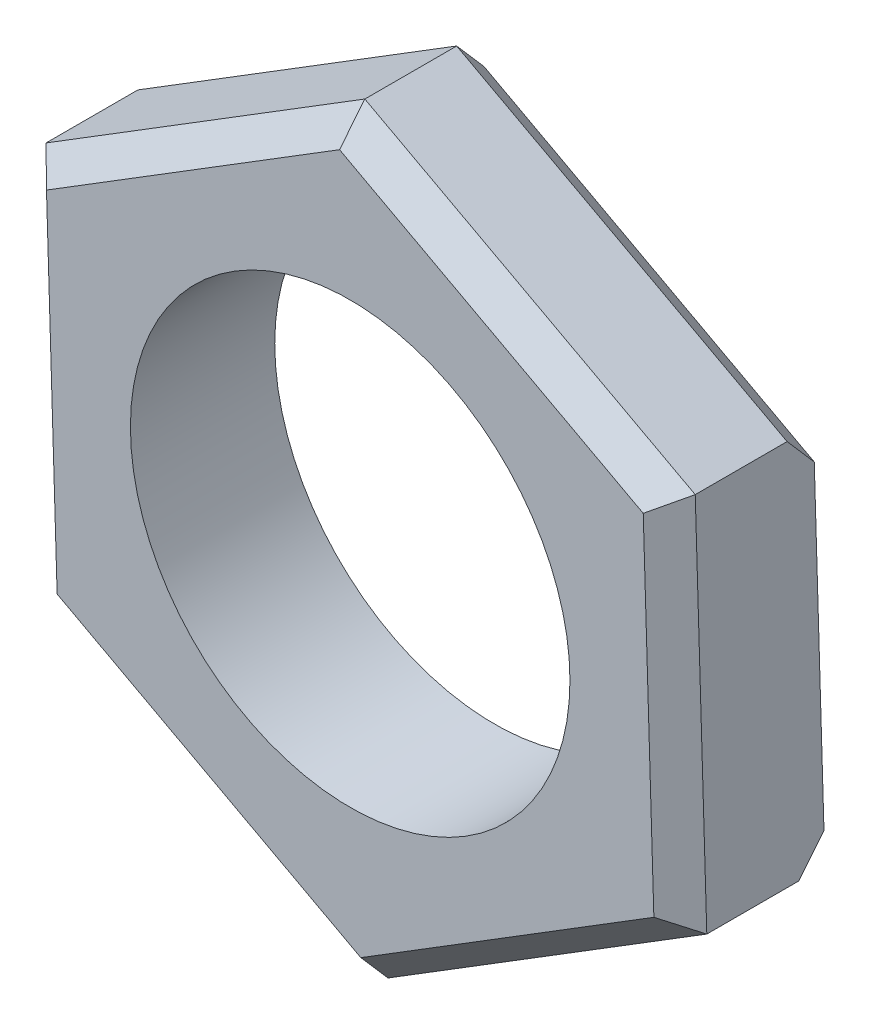
ISO-10303-21;
HEADER;
FILE_DESCRIPTION(('STEP AP214'),'2;1');
FILE_NAME('part.step','',(''),(''),'','','');
FILE_SCHEMA(('AUTOMOTIVE_DESIGN { 1 0 10303 214 1 1 1 1 }'));
ENDSEC;
DATA;
#1=APPLICATION_CONTEXT('core data for automotive mechanical design processes');
#2=APPLICATION_PROTOCOL_DEFINITION('international standard','automotive_design',2000,#1);
#3=PRODUCT_CONTEXT('',#1,'mechanical');
#4=PRODUCT('Part','Part','',(#3));
#5=PRODUCT_RELATED_PRODUCT_CATEGORY('part','',(#4));
#6=PRODUCT_DEFINITION_FORMATION('','',#4);
#7=PRODUCT_DEFINITION_CONTEXT('part definition',#1,'design');
#8=PRODUCT_DEFINITION('design','',#6,#7);
#9=PRODUCT_DEFINITION_SHAPE('','',#8);
#10=(LENGTH_UNIT() NAMED_UNIT(*) SI_UNIT(.MILLI.,.METRE.));
#11=(NAMED_UNIT(*) PLANE_ANGLE_UNIT() SI_UNIT($,.RADIAN.));
#12=(NAMED_UNIT(*) SI_UNIT($,.STERADIAN.) SOLID_ANGLE_UNIT());
#13=UNCERTAINTY_MEASURE_WITH_UNIT(LENGTH_MEASURE(1.E-05),#10,'distance_accuracy_value','');
#14=(GEOMETRIC_REPRESENTATION_CONTEXT(3) GLOBAL_UNCERTAINTY_ASSIGNED_CONTEXT((#13)) GLOBAL_UNIT_ASSIGNED_CONTEXT((#10,
#11,#12)) REPRESENTATION_CONTEXT('',''));
#15=CARTESIAN_POINT('',(0.,0.,0.));
#16=DIRECTION('',(0.,0.,1.));
#17=DIRECTION('',(1.,0.,0.));
#18=AXIS2_PLACEMENT_3D('',#15,#16,#17);
#19=CARTESIAN_POINT('',(0.,0.,2.2));
#20=DIRECTION('',(0.,0.,1.));
#21=DIRECTION('',(1.,0.,0.));
#22=AXIS2_PLACEMENT_3D('',#19,#20,#21);
#23=PLANE('',#22);
#24=DIRECTION('',(0.850174875779734,0.526500408919988,0.));
#25=VECTOR('',#24,1.);
#26=CARTESIAN_POINT('',(4.82527789286489,-2.3636186783467,2.2));
#27=LINE('',#26,#25);
#28=CARTESIAN_POINT('',(0.162215305662874,-5.25138263012152,2.2));
#29=VERTEX_POINT('',#28);
#30=CARTESIAN_POINT('',(4.62893841550902,-2.48520873947406,2.2));
#31=VERTEX_POINT('',#30);
#32=EDGE_CURVE('E51',#29,#31,#27,.T.);
#33=ORIENTED_EDGE('',*,*,#32,.T.);
#34=DIRECTION('',(-0.0308752913377375,0.999523244544523,0.));
#35=VECTOR('',#34,1.);
#36=CARTESIAN_POINT('',(4.45959276674008,2.99700389636709,2.2));
#37=LINE('',#36,#35);
#38=CARTESIAN_POINT('',(4.46672310984614,2.76617389064747,2.2));
#39=VERTEX_POINT('',#38);
#40=EDGE_CURVE('E11',#31,#39,#37,.T.);
#41=ORIENTED_EDGE('',*,*,#40,.T.);
#42=DIRECTION('',(-0.881050167117471,0.473022835624535,0.));
#43=VECTOR('',#42,1.);
#44=CARTESIAN_POINT('',(-0.365685126124808,5.36062257471379,2.2));
#45=LINE('',#44,#43);
#46=CARTESIAN_POINT('',(-0.162215305662873,5.25138263012153,2.2));
#47=VERTEX_POINT('',#46);
#48=EDGE_CURVE('E226',#39,#47,#45,.T.);
#49=ORIENTED_EDGE('',*,*,#48,.T.);
#50=DIRECTION('',(-0.850174875779734,-0.526500408919988,0.));
#51=VECTOR('',#50,1.);
#52=CARTESIAN_POINT('',(-4.82527789286489,2.3636186783467,2.2));
#53=LINE('',#52,#51);
#54=CARTESIAN_POINT('',(-4.62893841550902,2.48520873947406,2.2));
#55=VERTEX_POINT('',#54);
#56=EDGE_CURVE('E162',#47,#55,#53,.T.);
#57=ORIENTED_EDGE('',*,*,#56,.T.);
#58=DIRECTION('',(0.0308752913377375,-0.999523244544523,0.));
#59=VECTOR('',#58,1.);
#60=CARTESIAN_POINT('',(-4.45959276674008,-2.99700389636709,2.2));
#61=LINE('',#60,#59);
#62=CARTESIAN_POINT('',(-4.46672310984614,-2.76617389064747,2.2));
#63=VERTEX_POINT('',#62);
#64=EDGE_CURVE('E231',#55,#63,#61,.T.);
#65=ORIENTED_EDGE('',*,*,#64,.T.);
#66=DIRECTION('',(0.881050167117471,-0.473022835624535,0.));
#67=VECTOR('',#66,1.);
#68=CARTESIAN_POINT('',(0.365685126124808,-5.36062257471379,2.2));
#69=LINE('',#68,#67);
#70=EDGE_CURVE('E62',#63,#29,#69,.T.);
#71=ORIENTED_EDGE('',*,*,#70,.T.);
#72=EDGE_LOOP('',(#33,#41,#49,#57,#65,#71));
#73=FACE_BOUND('',#72,.T.);
#74=CARTESIAN_POINT('',(0.,0.,2.2));
#75=DIRECTION('',(0.,0.,1.));
#76=DIRECTION('',(1.,0.,0.));
#77=AXIS2_PLACEMENT_3D('',#74,#75,#76);
#78=CIRCLE('',#77,3.35);
#79=CARTESIAN_POINT('',(3.35,0.,2.2));
#80=VERTEX_POINT('',#79);
#81=EDGE_CURVE('E328',#80,#80,#78,.T.);
#82=ORIENTED_EDGE('',*,*,#81,.F.);
#83=EDGE_LOOP('',(#82));
#84=FACE_BOUND('',#83,.T.);
#85=ADVANCED_FACE('F41',(#73,#84),#23,.T.);
#86=CARTESIAN_POINT('',(0.,0.,0.));
#87=DIRECTION('',(0.,0.,1.));
#88=DIRECTION('',(1.,0.,0.));
#89=AXIS2_PLACEMENT_3D('',#86,#87,#88);
#90=PLANE('',#89);
#91=DIRECTION('',(0.850174875779734,0.526500408919988,0.));
#92=VECTOR('',#91,1.);
#93=CARTESIAN_POINT('',(-2.39557686058594,3.86829568479778,0.));
#94=LINE('',#93,#92);
#95=CARTESIAN_POINT('',(-4.62893841550901,2.48520873947405,0.));
#96=VERTEX_POINT('',#95);
#97=CARTESIAN_POINT('',(-0.162215305662872,5.25138263012152,0.));
#98=VERTEX_POINT('',#97);
#99=EDGE_CURVE('E191',#96,#98,#94,.T.);
#100=ORIENTED_EDGE('',*,*,#99,.T.);
#101=DIRECTION('',(0.881050167117471,-0.473022835624535,0.));
#102=VECTOR('',#101,1.);
#103=CARTESIAN_POINT('',(2.15225390209163,4.00877826038449,0.));
#104=LINE('',#103,#102);
#105=CARTESIAN_POINT('',(4.87366275077001,2.54769400146293,0.));
#106=VERTEX_POINT('',#105);
#107=EDGE_CURVE('E194',#98,#106,#104,.T.);
#108=ORIENTED_EDGE('',*,*,#107,.T.);
#109=DIRECTION('',(-0.0308752913377374,0.999523244544523,0.));
#110=VECTOR('',#109,1.);
#111=CARTESIAN_POINT('',(5.03587805643288,-2.70368862865859,0.));
#112=LINE('',#111,#110);
#113=CARTESIAN_POINT('',(5.02161737022076,-2.24202861721933,0.));
#114=VERTEX_POINT('',#113);
#115=EDGE_CURVE('E286',#114,#106,#112,.T.);
#116=ORIENTED_EDGE('',*,*,#115,.F.);
#117=DIRECTION('',(-0.850174875779734,-0.526500408919988,0.));
#118=VECTOR('',#117,1.);
#119=CARTESIAN_POINT('',(2.39557686058594,-3.86829568479778,0.));
#120=LINE('',#119,#118);
#121=CARTESIAN_POINT('',(0.162215305662873,-5.25138263012152,0.));
#122=VERTEX_POINT('',#121);
#123=EDGE_CURVE('E177',#114,#122,#120,.T.);
#124=ORIENTED_EDGE('',*,*,#123,.T.);
#125=DIRECTION('',(-0.881050167117471,0.473022835624535,0.));
#126=VECTOR('',#125,1.);
#127=CARTESIAN_POINT('',(-2.15225390209163,-4.00877826038449,0.));
#128=LINE('',#127,#126);
#129=CARTESIAN_POINT('',(-4.46672310984614,-2.76617389064746,0.));
#130=VERTEX_POINT('',#129);
#131=EDGE_CURVE('E185',#122,#130,#128,.T.);
#132=ORIENTED_EDGE('',*,*,#131,.T.);
#133=DIRECTION('',(-0.0308752913377375,0.999523244544523,0.));
#134=VECTOR('',#133,1.);
#135=CARTESIAN_POINT('',(-4.54783076267757,-0.140482575586705,0.));
#136=LINE('',#135,#134);
#137=EDGE_CURVE('E188',#130,#96,#136,.T.);
#138=ORIENTED_EDGE('',*,*,#137,.T.);
#139=EDGE_LOOP('',(#100,#108,#116,#124,#132,#138));
#140=FACE_BOUND('',#139,.T.);
#141=CARTESIAN_POINT('',(0.,0.,0.));
#142=DIRECTION('',(0.,0.,1.));
#143=DIRECTION('',(1.,0.,0.));
#144=AXIS2_PLACEMENT_3D('',#141,#142,#143);
#145=CIRCLE('',#144,3.35);
#146=CARTESIAN_POINT('',(3.35,0.,0.));
#147=VERTEX_POINT('',#146);
#148=EDGE_CURVE('E253',#147,#147,#145,.T.);
#149=ORIENTED_EDGE('',*,*,#148,.T.);
#150=EDGE_LOOP('',(#149));
#151=FACE_BOUND('',#150,.T.);
#152=ADVANCED_FACE('F325',(#140,#151),#90,.F.);
#153=CARTESIAN_POINT('',(0.176475991874994,-5.71304264156078,2.2));
#154=DIRECTION('',(-0.526500408919988,0.850174875779734,0.));
#155=DIRECTION('',(-0.850174875779734,-0.526500408919988,0.));
#156=AXIS2_PLACEMENT_3D('',#153,#154,#155);
#157=PLANE('',#156);
#158=DIRECTION('',(0.,0.,-1.));
#159=VECTOR('',#158,1.);
#160=CARTESIAN_POINT('',(0.176475991874994,-5.71304264156078,2.2));
#161=LINE('',#160,#159);
#162=CARTESIAN_POINT('',(0.176475991874994,-5.71304264156078,1.8));
#163=VERTEX_POINT('',#162);
#164=CARTESIAN_POINT('',(0.176475991874994,-5.71304264156078,0.400000000000002));
#165=VERTEX_POINT('',#164);
#166=EDGE_CURVE('E280',#163,#165,#161,.T.);
#167=ORIENTED_EDGE('',*,*,#166,.T.);
#168=DIRECTION('',(0.850174875779734,0.526500408919988,0.));
#169=VECTOR('',#168,1.);
#170=CARTESIAN_POINT('',(0.176475991874994,-5.71304264156078,0.400000000000002));
#171=LINE('',#170,#169);
#172=CARTESIAN_POINT('',(5.03587805643288,-2.70368862865859,0.400000000000002));
#173=VERTEX_POINT('',#172);
#174=EDGE_CURVE('E223',#165,#173,#171,.T.);
#175=ORIENTED_EDGE('',*,*,#174,.T.);
#176=DIRECTION('',(0.,0.,-1.));
#177=VECTOR('',#176,1.);
#178=CARTESIAN_POINT('',(5.03587805643288,-2.70368862865859,2.2));
#179=LINE('',#178,#177);
#180=CARTESIAN_POINT('',(5.03587805643288,-2.70368862865859,1.8));
#181=VERTEX_POINT('',#180);
#182=EDGE_CURVE('E173',#181,#173,#179,.T.);
#183=ORIENTED_EDGE('',*,*,#182,.F.);
#184=DIRECTION('',(-0.850174875779734,-0.526500408919988,0.));
#185=VECTOR('',#184,1.);
#186=CARTESIAN_POINT('',(0.176475991874994,-5.71304264156078,1.8));
#187=LINE('',#186,#185);
#188=EDGE_CURVE('E220',#181,#163,#187,.T.);
#189=ORIENTED_EDGE('',*,*,#188,.T.);
#190=EDGE_LOOP('',(#167,#175,#183,#189));
#191=FACE_BOUND('',#190,.T.);
#192=ADVANCED_FACE('F314',(#191),#157,.F.);
#193=CARTESIAN_POINT('',(5.03587805643288,-2.70368862865859,2.2));
#194=DIRECTION('',(-0.999523244544523,-0.0308752913377374,0.));
#195=DIRECTION('',(0.0308752913377375,-0.999523244544523,0.));
#196=AXIS2_PLACEMENT_3D('',#193,#194,#195);
#197=PLANE('',#196);
#198=ORIENTED_EDGE('',*,*,#115,.T.);
#199=DIRECTION('',(0.0233395264389487,-0.755568552769489,-0.654653670707974));
#200=VECTOR('',#199,1.);
#201=CARTESIAN_POINT('',(4.85940206455789,3.00935401290219,0.400000000000003));
#202=LINE('',#201,#200);
#203=CARTESIAN_POINT('',(4.85940206455789,3.00935401290219,0.400000000000003));
#204=VERTEX_POINT('',#203);
#205=EDGE_CURVE('E144',#106,#204,#202,.F.);
#206=ORIENTED_EDGE('',*,*,#205,.T.);
#207=DIRECTION('',(0.,0.,-1.));
#208=VECTOR('',#207,1.);
#209=CARTESIAN_POINT('',(4.85940206455789,3.00935401290219,2.2));
#210=LINE('',#209,#208);
#211=CARTESIAN_POINT('',(4.85940206455789,3.00935401290219,1.8));
#212=VERTEX_POINT('',#211);
#213=EDGE_CURVE('E156',#212,#204,#210,.T.);
#214=ORIENTED_EDGE('',*,*,#213,.F.);
#215=DIRECTION('',(0.0308752913377375,-0.999523244544523,0.));
#216=VECTOR('',#215,1.);
#217=CARTESIAN_POINT('',(5.03587805643288,-2.70368862865859,1.8));
#218=LINE('',#217,#216);
#219=EDGE_CURVE('E197',#212,#181,#218,.T.);
#220=ORIENTED_EDGE('',*,*,#219,.T.);
#221=ORIENTED_EDGE('',*,*,#182,.T.);
#222=DIRECTION('',(0.0233395264389487,-0.75556855276949,0.654653670707974));
#223=VECTOR('',#222,1.);
#224=CARTESIAN_POINT('',(5.08629976839717,-4.33598652624739,1.81428571428572));
#225=LINE('',#224,#223);
#226=EDGE_CURVE('E201',#173,#114,#225,.F.);
#227=ORIENTED_EDGE('',*,*,#226,.T.);
#228=EDGE_LOOP('',(#198,#206,#214,#220,#221,#227));
#229=FACE_BOUND('',#228,.T.);
#230=ADVANCED_FACE('F323',(#229),#197,.F.);
#231=CARTESIAN_POINT('',(4.85940206455789,3.00935401290219,2.2));
#232=DIRECTION('',(-0.473022835624535,-0.881050167117471,0.));
#233=DIRECTION('',(0.881050167117471,-0.473022835624535,0.));
#234=AXIS2_PLACEMENT_3D('',#231,#232,#233);
#235=PLANE('',#234);
#236=ORIENTED_EDGE('',*,*,#213,.T.);
#237=DIRECTION('',(-0.881050167117471,0.473022835624535,0.));
#238=VECTOR('',#237,1.);
#239=CARTESIAN_POINT('',(4.85940206455789,3.00935401290219,0.400000000000003));
#240=LINE('',#239,#238);
#241=CARTESIAN_POINT('',(-0.176475991874994,5.71304264156078,0.400000000000002));
#242=VERTEX_POINT('',#241);
#243=EDGE_CURVE('E154',#204,#242,#240,.T.);
#244=ORIENTED_EDGE('',*,*,#243,.T.);
#245=DIRECTION('',(0.,0.,-1.));
#246=VECTOR('',#245,1.);
#247=CARTESIAN_POINT('',(-0.176475991874994,5.71304264156078,2.2));
#248=LINE('',#247,#246);
#249=CARTESIAN_POINT('',(-0.176475991874994,5.71304264156078,1.8));
#250=VERTEX_POINT('',#249);
#251=EDGE_CURVE('E135',#250,#242,#248,.T.);
#252=ORIENTED_EDGE('',*,*,#251,.F.);
#253=DIRECTION('',(0.881050167117471,-0.473022835624535,0.));
#254=VECTOR('',#253,1.);
#255=CARTESIAN_POINT('',(4.85940206455789,3.00935401290219,1.8));
#256=LINE('',#255,#254);
#257=EDGE_CURVE('E151',#250,#212,#256,.T.);
#258=ORIENTED_EDGE('',*,*,#257,.T.);
#259=EDGE_LOOP('',(#236,#244,#252,#258));
#260=FACE_BOUND('',#259,.T.);
#261=ADVANCED_FACE('F149',(#260),#235,.F.);
#262=CARTESIAN_POINT('',(-0.176475991874994,5.71304264156078,2.2));
#263=DIRECTION('',(0.526500408919988,-0.850174875779734,0.));
#264=DIRECTION('',(0.850174875779734,0.526500408919988,0.));
#265=AXIS2_PLACEMENT_3D('',#262,#263,#264);
#266=PLANE('',#265);
#267=ORIENTED_EDGE('',*,*,#251,.T.);
#268=DIRECTION('',(-0.850174875779734,-0.526500408919988,0.));
#269=VECTOR('',#268,1.);
#270=CARTESIAN_POINT('',(-0.176475991874994,5.71304264156078,0.400000000000002));
#271=LINE('',#270,#269);
#272=CARTESIAN_POINT('',(-5.03587805643289,2.70368862865859,0.400000000000003));
#273=VERTEX_POINT('',#272);
#274=EDGE_CURVE('E143',#242,#273,#271,.T.);
#275=ORIENTED_EDGE('',*,*,#274,.T.);
#276=DIRECTION('',(0.,0.,-1.));
#277=VECTOR('',#276,1.);
#278=CARTESIAN_POINT('',(-5.03587805643289,2.70368862865859,2.2));
#279=LINE('',#278,#277);
#280=CARTESIAN_POINT('',(-5.03587805643289,2.70368862865859,1.8));
#281=VERTEX_POINT('',#280);
#282=EDGE_CURVE('E137',#281,#273,#279,.T.);
#283=ORIENTED_EDGE('',*,*,#282,.F.);
#284=DIRECTION('',(0.850174875779734,0.526500408919988,0.));
#285=VECTOR('',#284,1.);
#286=CARTESIAN_POINT('',(-0.176475991874994,5.71304264156078,1.8));
#287=LINE('',#286,#285);
#288=EDGE_CURVE('E132',#281,#250,#287,.T.);
#289=ORIENTED_EDGE('',*,*,#288,.T.);
#290=EDGE_LOOP('',(#267,#275,#283,#289));
#291=FACE_BOUND('',#290,.T.);
#292=ADVANCED_FACE('F134',(#291),#266,.F.);
#293=CARTESIAN_POINT('',(-5.03587805643289,2.70368862865859,2.2));
#294=DIRECTION('',(0.999523244544523,0.0308752913377374,0.));
#295=DIRECTION('',(-0.0308752913377375,0.999523244544523,0.));
#296=AXIS2_PLACEMENT_3D('',#293,#294,#295);
#297=PLANE('',#296);
#298=ORIENTED_EDGE('',*,*,#282,.T.);
#299=DIRECTION('',(0.0308752913377375,-0.999523244544523,0.));
#300=VECTOR('',#299,1.);
#301=CARTESIAN_POINT('',(-5.03587805643289,2.70368862865859,0.400000000000003));
#302=LINE('',#301,#300);
#303=CARTESIAN_POINT('',(-4.85940206455789,-3.00935401290219,0.400000000000003));
#304=VERTEX_POINT('',#303);
#305=EDGE_CURVE('E211',#273,#304,#302,.T.);
#306=ORIENTED_EDGE('',*,*,#305,.T.);
#307=DIRECTION('',(0.,0.,-1.));
#308=VECTOR('',#307,1.);
#309=CARTESIAN_POINT('',(-4.85940206455789,-3.00935401290219,2.2));
#310=LINE('',#309,#308);
#311=CARTESIAN_POINT('',(-4.85940206455789,-3.00935401290219,1.8));
#312=VERTEX_POINT('',#311);
#313=EDGE_CURVE('E276',#312,#304,#310,.T.);
#314=ORIENTED_EDGE('',*,*,#313,.F.);
#315=DIRECTION('',(-0.0308752913377375,0.999523244544523,0.));
#316=VECTOR('',#315,1.);
#317=CARTESIAN_POINT('',(-5.03587805643289,2.70368862865859,1.8));
#318=LINE('',#317,#316);
#319=EDGE_CURVE('E208',#312,#281,#318,.T.);
#320=ORIENTED_EDGE('',*,*,#319,.T.);
#321=EDGE_LOOP('',(#298,#306,#314,#320));
#322=FACE_BOUND('',#321,.T.);
#323=ADVANCED_FACE('F273',(#322),#297,.F.);
#324=CARTESIAN_POINT('',(-4.85940206455789,-3.00935401290219,2.2));
#325=DIRECTION('',(0.473022835624535,0.881050167117471,0.));
#326=DIRECTION('',(-0.881050167117471,0.473022835624535,0.));
#327=AXIS2_PLACEMENT_3D('',#324,#325,#326);
#328=PLANE('',#327);
#329=ORIENTED_EDGE('',*,*,#313,.T.);
#330=DIRECTION('',(0.881050167117471,-0.473022835624535,0.));
#331=VECTOR('',#330,1.);
#332=CARTESIAN_POINT('',(-4.85940206455789,-3.00935401290219,0.400000000000003));
#333=LINE('',#332,#331);
#334=EDGE_CURVE('E217',#304,#165,#333,.T.);
#335=ORIENTED_EDGE('',*,*,#334,.T.);
#336=ORIENTED_EDGE('',*,*,#166,.F.);
#337=DIRECTION('',(-0.881050167117471,0.473022835624535,0.));
#338=VECTOR('',#337,1.);
#339=CARTESIAN_POINT('',(-4.85940206455789,-3.00935401290219,1.8));
#340=LINE('',#339,#338);
#341=EDGE_CURVE('E214',#163,#312,#340,.T.);
#342=ORIENTED_EDGE('',*,*,#341,.T.);
#343=EDGE_LOOP('',(#329,#335,#336,#342));
#344=FACE_BOUND('',#343,.T.);
#345=ADVANCED_FACE('F311',(#344),#328,.F.);
#346=CARTESIAN_POINT('',(0.,0.,2.2));
#347=DIRECTION('',(0.,0.,-1.));
#348=DIRECTION('',(-1.,0.,0.));
#349=AXIS2_PLACEMENT_3D('',#346,#347,#348);
#350=CYLINDRICAL_SURFACE('',#349,3.35);
#351=ORIENTED_EDGE('',*,*,#81,.T.);
#352=EDGE_LOOP('',(#351));
#353=FACE_BOUND('',#352,.T.);
#354=ORIENTED_EDGE('',*,*,#148,.F.);
#355=EDGE_LOOP('',(#354));
#356=FACE_BOUND('',#355,.T.);
#357=ADVANCED_FACE('F337',(#353,#356),#350,.F.);
#358=CARTESIAN_POINT('',(0.176475991874994,-5.71304264156078,0.400000000000003));
#359=DIRECTION('',(-0.372292009444812,0.601164419858278,0.70710678118655));
#360=DIRECTION('',(0.850174875779734,0.526500408919988,0.));
#361=AXIS2_PLACEMENT_3D('',#358,#359,#360);
#362=PLANE('',#361);
#363=ORIENTED_EDGE('',*,*,#226,.F.);
#364=ORIENTED_EDGE('',*,*,#174,.F.);
#365=DIRECTION('',(-0.0233395264389481,0.75556855276949,-0.654653670707974));
#366=VECTOR('',#365,1.);
#367=CARTESIAN_POINT('',(0.176475991874994,-5.71304264156078,0.400000000000003));
#368=LINE('',#367,#366);
#369=EDGE_CURVE('E249',#122,#165,#368,.F.);
#370=ORIENTED_EDGE('',*,*,#369,.F.);
#371=ORIENTED_EDGE('',*,*,#123,.F.);
#372=EDGE_LOOP('',(#363,#364,#370,#371));
#373=FACE_BOUND('',#372,.T.);
#374=ADVANCED_FACE('F319',(#373),#362,.F.);
#375=CARTESIAN_POINT('',(-4.85940206455789,-3.00935401290219,0.400000000000003));
#376=DIRECTION('',(0.334477654726197,0.622996547734302,0.707106781186551));
#377=DIRECTION('',(0.881050167117471,-0.473022835624535,0.));
#378=AXIS2_PLACEMENT_3D('',#375,#376,#377);
#379=PLANE('',#378);
#380=ORIENTED_EDGE('',*,*,#369,.T.);
#381=ORIENTED_EDGE('',*,*,#334,.F.);
#382=DIRECTION('',(0.642671797779546,0.397996899193174,-0.654653670707974));
#383=VECTOR('',#382,1.);
#384=CARTESIAN_POINT('',(-4.85940206455789,-3.00935401290219,0.400000000000003));
#385=LINE('',#384,#383);
#386=EDGE_CURVE('E245',#130,#304,#385,.F.);
#387=ORIENTED_EDGE('',*,*,#386,.F.);
#388=ORIENTED_EDGE('',*,*,#131,.F.);
#389=EDGE_LOOP('',(#380,#381,#387,#388));
#390=FACE_BOUND('',#389,.T.);
#391=ADVANCED_FACE('F308',(#390),#379,.F.);
#392=CARTESIAN_POINT('',(-5.03587805643289,2.70368862865859,0.400000000000003));
#393=DIRECTION('',(0.70676966417101,0.0218321278760244,0.70710678118655));
#394=DIRECTION('',(0.0308752913377375,-0.999523244544523,0.));
#395=AXIS2_PLACEMENT_3D('',#392,#393,#394);
#396=PLANE('',#395);
#397=ORIENTED_EDGE('',*,*,#386,.T.);
#398=ORIENTED_EDGE('',*,*,#305,.F.);
#399=DIRECTION('',(0.666011324218495,-0.357571653576317,-0.654653670707975));
#400=VECTOR('',#399,1.);
#401=CARTESIAN_POINT('',(-5.03587805643289,2.70368862865859,0.400000000000003));
#402=LINE('',#401,#400);
#403=EDGE_CURVE('E241',#96,#273,#402,.F.);
#404=ORIENTED_EDGE('',*,*,#403,.F.);
#405=ORIENTED_EDGE('',*,*,#137,.F.);
#406=EDGE_LOOP('',(#397,#398,#404,#405));
#407=FACE_BOUND('',#406,.T.);
#408=ADVANCED_FACE('F304',(#407),#396,.F.);
#409=CARTESIAN_POINT('',(-0.176475991874994,5.71304264156078,0.400000000000003));
#410=DIRECTION('',(0.372292009444812,-0.601164419858278,0.70710678118655));
#411=DIRECTION('',(-0.850174875779734,-0.526500408919988,0.));
#412=AXIS2_PLACEMENT_3D('',#409,#410,#411);
#413=PLANE('',#412);
#414=ORIENTED_EDGE('',*,*,#403,.T.);
#415=ORIENTED_EDGE('',*,*,#274,.F.);
#416=DIRECTION('',(0.0233395264389489,-0.755568552769489,-0.654653670707975));
#417=VECTOR('',#416,1.);
#418=CARTESIAN_POINT('',(-0.176475991874994,5.71304264156078,0.400000000000003));
#419=LINE('',#418,#417);
#420=EDGE_CURVE('E238',#98,#242,#419,.F.);
#421=ORIENTED_EDGE('',*,*,#420,.F.);
#422=ORIENTED_EDGE('',*,*,#99,.F.);
#423=EDGE_LOOP('',(#414,#415,#421,#422));
#424=FACE_BOUND('',#423,.T.);
#425=ADVANCED_FACE('F300',(#424),#413,.F.);
#426=CARTESIAN_POINT('',(4.85940206455789,3.00935401290219,0.400000000000003));
#427=DIRECTION('',(-0.334477654726197,-0.622996547734303,0.70710678118655));
#428=DIRECTION('',(-0.881050167117471,0.473022835624535,0.));
#429=AXIS2_PLACEMENT_3D('',#426,#427,#428);
#430=PLANE('',#429);
#431=ORIENTED_EDGE('',*,*,#205,.F.);
#432=ORIENTED_EDGE('',*,*,#107,.F.);
#433=ORIENTED_EDGE('',*,*,#420,.T.);
#434=ORIENTED_EDGE('',*,*,#243,.F.);
#435=EDGE_LOOP('',(#431,#432,#433,#434));
#436=FACE_BOUND('',#435,.T.);
#437=ADVANCED_FACE('F294',(#436),#430,.F.);
#438=CARTESIAN_POINT('',(-4.54783076267758,-0.140482575586705,2.2));
#439=DIRECTION('',(-0.706769664171014,-0.0218321278760245,0.707106781186545));
#440=DIRECTION('',(-0.0308752913377375,0.999523244544523,0.));
#441=AXIS2_PLACEMENT_3D('',#438,#439,#440);
#442=PLANE('',#441);
#443=DIRECTION('',(0.666011324218491,-0.357571653576315,0.65465367070798));
#444=VECTOR('',#443,1.);
#445=CARTESIAN_POINT('',(-3.96766149900773,2.13017891954919,2.85));
#446=LINE('',#445,#444);
#447=EDGE_CURVE('E260',#281,#55,#446,.T.);
#448=ORIENTED_EDGE('',*,*,#447,.F.);
#449=ORIENTED_EDGE('',*,*,#319,.F.);
#450=DIRECTION('',(0.642671797779543,0.397996899193171,0.65465367070798));
#451=VECTOR('',#450,1.);
#452=CARTESIAN_POINT('',(-3.82861980843955,-2.37100619198354,2.85));
#453=LINE('',#452,#451);
#454=EDGE_CURVE('E45',#63,#312,#453,.F.);
#455=ORIENTED_EDGE('',*,*,#454,.F.);
#456=ORIENTED_EDGE('',*,*,#64,.F.);
#457=EDGE_LOOP('',(#448,#449,#455,#456));
#458=FACE_BOUND('',#457,.T.);
#459=ADVANCED_FACE('F43',(#458),#442,.T.);
#460=CARTESIAN_POINT('',(-2.15225390209164,-4.00877826038449,2.2));
#461=DIRECTION('',(-0.334477654726199,-0.622996547734306,0.707106781186545));
#462=DIRECTION('',(-0.881050167117471,0.473022835624535,0.));
#463=AXIS2_PLACEMENT_3D('',#460,#461,#462);
#464=PLANE('',#463);
#465=ORIENTED_EDGE('',*,*,#454,.T.);
#466=ORIENTED_EDGE('',*,*,#341,.F.);
#467=DIRECTION('',(-0.0233395264389477,0.755568552769485,0.65465367070798));
#468=VECTOR('',#467,1.);
#469=CARTESIAN_POINT('',(0.139041690568178,-4.50118511153274,2.85));
#470=LINE('',#469,#468);
#471=EDGE_CURVE('E166',#29,#163,#470,.F.);
#472=ORIENTED_EDGE('',*,*,#471,.F.);
#473=ORIENTED_EDGE('',*,*,#70,.F.);
#474=EDGE_LOOP('',(#465,#466,#472,#473));
#475=FACE_BOUND('',#474,.T.);
#476=ADVANCED_FACE('F267',(#475),#464,.T.);
#477=CARTESIAN_POINT('',(-2.39557686058595,3.86829568479779,2.2));
#478=DIRECTION('',(-0.372292009444815,0.601164419858282,0.707106781186545));
#479=DIRECTION('',(0.850174875779734,0.526500408919988,0.));
#480=AXIS2_PLACEMENT_3D('',#477,#478,#479);
#481=PLANE('',#480);
#482=ORIENTED_EDGE('',*,*,#447,.T.);
#483=ORIENTED_EDGE('',*,*,#56,.F.);
#484=DIRECTION('',(0.0233395264389497,-0.755568552769485,0.65465367070798));
#485=VECTOR('',#484,1.);
#486=CARTESIAN_POINT('',(-0.139041690568175,4.50118511153274,2.85));
#487=LINE('',#486,#485);
#488=EDGE_CURVE('E160',#250,#47,#487,.T.);
#489=ORIENTED_EDGE('',*,*,#488,.F.);
#490=ORIENTED_EDGE('',*,*,#288,.F.);
#491=EDGE_LOOP('',(#482,#483,#489,#490));
#492=FACE_BOUND('',#491,.T.);
#493=ADVANCED_FACE('F161',(#492),#481,.T.);
#494=CARTESIAN_POINT('',(2.39557686058595,-3.86829568479779,2.2));
#495=DIRECTION('',(0.372292009444815,-0.601164419858283,0.707106781186545));
#496=DIRECTION('',(-0.850174875779734,-0.526500408919988,0.));
#497=AXIS2_PLACEMENT_3D('',#494,#495,#496);
#498=PLANE('',#497);
#499=ORIENTED_EDGE('',*,*,#471,.T.);
#500=ORIENTED_EDGE('',*,*,#188,.F.);
#501=DIRECTION('',(-0.666011324218491,0.357571653576314,0.65465367070798));
#502=VECTOR('',#501,1.);
#503=CARTESIAN_POINT('',(3.96766149900773,-2.13017891954919,2.85));
#504=LINE('',#503,#502);
#505=EDGE_CURVE('E167',#31,#181,#504,.F.);
#506=ORIENTED_EDGE('',*,*,#505,.F.);
#507=ORIENTED_EDGE('',*,*,#32,.F.);
#508=EDGE_LOOP('',(#499,#500,#506,#507));
#509=FACE_BOUND('',#508,.T.);
#510=ADVANCED_FACE('F379',(#509),#498,.T.);
#511=CARTESIAN_POINT('',(2.15225390209164,4.0087782603845,2.2));
#512=DIRECTION('',(0.3344776547262,0.622996547734307,0.707106781186545));
#513=DIRECTION('',(0.881050167117471,-0.473022835624535,0.));
#514=AXIS2_PLACEMENT_3D('',#511,#512,#513);
#515=PLANE('',#514);
#516=ORIENTED_EDGE('',*,*,#488,.T.);
#517=ORIENTED_EDGE('',*,*,#48,.F.);
#518=DIRECTION('',(0.642671797779543,0.39799689919317,-0.65465367070798));
#519=VECTOR('',#518,1.);
#520=CARTESIAN_POINT('',(3.82861980843955,2.37100619198355,2.85));
#521=LINE('',#520,#519);
#522=EDGE_CURVE('E171',#212,#39,#521,.F.);
#523=ORIENTED_EDGE('',*,*,#522,.F.);
#524=ORIENTED_EDGE('',*,*,#257,.F.);
#525=EDGE_LOOP('',(#516,#517,#523,#524));
#526=FACE_BOUND('',#525,.T.);
#527=ADVANCED_FACE('F170',(#526),#515,.T.);
#528=CARTESIAN_POINT('',(4.54783076267758,0.140482575586705,2.2));
#529=DIRECTION('',(0.706769664171014,0.0218321278760245,0.707106781186545));
#530=DIRECTION('',(0.0308752913377375,-0.999523244544523,0.));
#531=AXIS2_PLACEMENT_3D('',#528,#529,#530);
#532=PLANE('',#531);
#533=ORIENTED_EDGE('',*,*,#505,.T.);
#534=ORIENTED_EDGE('',*,*,#219,.F.);
#535=ORIENTED_EDGE('',*,*,#522,.T.);
#536=ORIENTED_EDGE('',*,*,#40,.F.);
#537=EDGE_LOOP('',(#533,#534,#535,#536));
#538=FACE_BOUND('',#537,.T.);
#539=ADVANCED_FACE('F373',(#538),#532,.T.);
#540=CLOSED_SHELL('',(#85,#152,#192,#230,#261,#292,#323,#345,#357,#374,#391,#408,#425,#437,#459,
#476,#493,#510,#527,#539));
#541=MANIFOLD_SOLID_BREP('B2',#540);
#542=ADVANCED_BREP_SHAPE_REPRESENTATION('',(#18,#541),#14);
#543=SHAPE_DEFINITION_REPRESENTATION(#9,#542);
ENDSEC;
END-ISO-10303-21;
